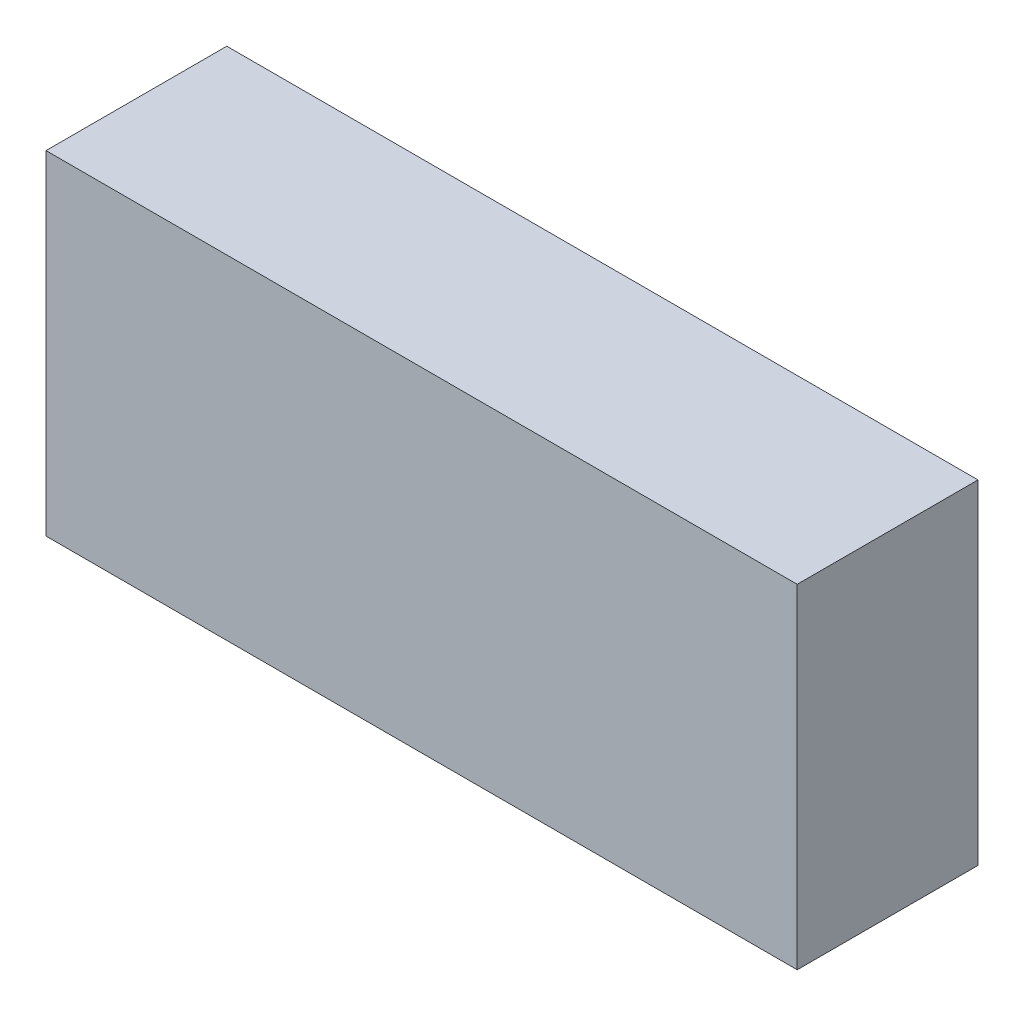
ISO-10303-21;
HEADER;
FILE_DESCRIPTION(('STEP AP214'),'2;1');
FILE_NAME('part.step','',(''),(''),'','','');
FILE_SCHEMA(('AUTOMOTIVE_DESIGN { 1 0 10303 214 1 1 1 1 }'));
ENDSEC;
DATA;
#1=APPLICATION_CONTEXT('core data for automotive mechanical design processes');
#2=APPLICATION_PROTOCOL_DEFINITION('international standard','automotive_design',2000,#1);
#3=PRODUCT_CONTEXT('',#1,'mechanical');
#4=PRODUCT('Part','Part','',(#3));
#5=PRODUCT_RELATED_PRODUCT_CATEGORY('part','',(#4));
#6=PRODUCT_DEFINITION_FORMATION('','',#4);
#7=PRODUCT_DEFINITION_CONTEXT('part definition',#1,'design');
#8=PRODUCT_DEFINITION('design','',#6,#7);
#9=PRODUCT_DEFINITION_SHAPE('','',#8);
#10=(LENGTH_UNIT() NAMED_UNIT(*) SI_UNIT(.MILLI.,.METRE.));
#11=(NAMED_UNIT(*) PLANE_ANGLE_UNIT() SI_UNIT($,.RADIAN.));
#12=(NAMED_UNIT(*) SI_UNIT($,.STERADIAN.) SOLID_ANGLE_UNIT());
#13=UNCERTAINTY_MEASURE_WITH_UNIT(LENGTH_MEASURE(1.E-05),#10,'distance_accuracy_value','');
#14=(GEOMETRIC_REPRESENTATION_CONTEXT(3) GLOBAL_UNCERTAINTY_ASSIGNED_CONTEXT((#13)) GLOBAL_UNIT_ASSIGNED_CONTEXT((#10,
#11,#12)) REPRESENTATION_CONTEXT('',''));
#15=CARTESIAN_POINT('',(0.,0.,0.));
#16=DIRECTION('',(0.,0.,1.));
#17=DIRECTION('',(1.,0.,0.));
#18=AXIS2_PLACEMENT_3D('',#15,#16,#17);
#19=CARTESIAN_POINT('',(-1.661922,-0.738632,0.80000094));
#20=DIRECTION('',(0.,0.,1.));
#21=DIRECTION('',(1.,0.,0.));
#22=AXIS2_PLACEMENT_3D('',#19,#20,#21);
#23=PLANE('',#22);
#24=DIRECTION('',(1.,0.,0.));
#25=VECTOR('',#24,1.);
#26=CARTESIAN_POINT('',(-1.661922,0.738632,0.80000094));
#27=LINE('',#26,#25);
#28=CARTESIAN_POINT('',(-1.661922,0.738632,0.80000094));
#29=VERTEX_POINT('',#28);
#30=CARTESIAN_POINT('',(1.661922,0.738632,0.80000094));
#31=VERTEX_POINT('',#30);
#32=EDGE_CURVE('E53',#29,#31,#27,.T.);
#33=ORIENTED_EDGE('',*,*,#32,.F.);
#34=DIRECTION('',(0.,1.,0.));
#35=VECTOR('',#34,1.);
#36=CARTESIAN_POINT('',(-1.661922,-0.738632,0.80000094));
#37=LINE('',#36,#35);
#38=CARTESIAN_POINT('',(-1.661922,-0.738632,0.80000094));
#39=VERTEX_POINT('',#38);
#40=EDGE_CURVE('E20',#29,#39,#37,.F.);
#41=ORIENTED_EDGE('',*,*,#40,.T.);
#42=DIRECTION('',(1.,0.,0.));
#43=VECTOR('',#42,1.);
#44=CARTESIAN_POINT('',(1.661922,-0.738632,0.80000094));
#45=LINE('',#44,#43);
#46=CARTESIAN_POINT('',(1.661922,-0.738632,0.80000094));
#47=VERTEX_POINT('',#46);
#48=EDGE_CURVE('E67',#47,#39,#45,.F.);
#49=ORIENTED_EDGE('',*,*,#48,.F.);
#50=DIRECTION('',(0.,1.,0.));
#51=VECTOR('',#50,1.);
#52=CARTESIAN_POINT('',(1.661922,0.738632,0.80000094));
#53=LINE('',#52,#51);
#54=EDGE_CURVE('E58',#31,#47,#53,.F.);
#55=ORIENTED_EDGE('',*,*,#54,.F.);
#56=EDGE_LOOP('',(#33,#41,#49,#55));
#57=FACE_BOUND('',#56,.T.);
#58=ADVANCED_FACE('F17',(#57),#23,.T.);
#59=CARTESIAN_POINT('',(1.661922,-0.738632,0.));
#60=DIRECTION('',(0.,-1.,0.));
#61=DIRECTION('',(0.,0.,-1.));
#62=AXIS2_PLACEMENT_3D('',#59,#60,#61);
#63=PLANE('',#62);
#64=DIRECTION('',(0.,0.,1.));
#65=VECTOR('',#64,1.);
#66=CARTESIAN_POINT('',(-1.661922,-0.738632,0.));
#67=LINE('',#66,#65);
#68=CARTESIAN_POINT('',(-1.661922,-0.738632,0.));
#69=VERTEX_POINT('',#68);
#70=EDGE_CURVE('E80',#69,#39,#67,.T.);
#71=ORIENTED_EDGE('',*,*,#70,.F.);
#72=DIRECTION('',(1.,0.,0.));
#73=VECTOR('',#72,1.);
#74=CARTESIAN_POINT('',(-1.661922,-0.738632,0.));
#75=LINE('',#74,#73);
#76=CARTESIAN_POINT('',(1.661922,-0.738632,0.));
#77=VERTEX_POINT('',#76);
#78=EDGE_CURVE('E75',#69,#77,#75,.T.);
#79=ORIENTED_EDGE('',*,*,#78,.T.);
#80=DIRECTION('',(0.,0.,-1.));
#81=VECTOR('',#80,1.);
#82=CARTESIAN_POINT('',(1.661922,-0.738632,0.));
#83=LINE('',#82,#81);
#84=EDGE_CURVE('E63',#47,#77,#83,.T.);
#85=ORIENTED_EDGE('',*,*,#84,.F.);
#86=ORIENTED_EDGE('',*,*,#48,.T.);
#87=EDGE_LOOP('',(#71,#79,#85,#86));
#88=FACE_BOUND('',#87,.T.);
#89=ADVANCED_FACE('F74',(#88),#63,.T.);
#90=CARTESIAN_POINT('',(1.661922,0.738632,0.));
#91=DIRECTION('',(1.,0.,0.));
#92=DIRECTION('',(0.,0.,-1.));
#93=AXIS2_PLACEMENT_3D('',#90,#91,#92);
#94=PLANE('',#93);
#95=ORIENTED_EDGE('',*,*,#84,.T.);
#96=DIRECTION('',(0.,1.,0.));
#97=VECTOR('',#96,1.);
#98=CARTESIAN_POINT('',(1.661922,-0.738632,0.));
#99=LINE('',#98,#97);
#100=CARTESIAN_POINT('',(1.661922,0.738632,0.));
#101=VERTEX_POINT('',#100);
#102=EDGE_CURVE('E84',#77,#101,#99,.T.);
#103=ORIENTED_EDGE('',*,*,#102,.T.);
#104=DIRECTION('',(0.,0.,1.));
#105=VECTOR('',#104,1.);
#106=CARTESIAN_POINT('',(1.661922,0.738632,0.));
#107=LINE('',#106,#105);
#108=EDGE_CURVE('E65',#31,#101,#107,.F.);
#109=ORIENTED_EDGE('',*,*,#108,.F.);
#110=ORIENTED_EDGE('',*,*,#54,.T.);
#111=EDGE_LOOP('',(#95,#103,#109,#110));
#112=FACE_BOUND('',#111,.T.);
#113=ADVANCED_FACE('F60',(#112),#94,.T.);
#114=CARTESIAN_POINT('',(-1.661922,0.738632,0.));
#115=DIRECTION('',(0.,1.,0.));
#116=DIRECTION('',(0.,0.,1.));
#117=AXIS2_PLACEMENT_3D('',#114,#115,#116);
#118=PLANE('',#117);
#119=ORIENTED_EDGE('',*,*,#108,.T.);
#120=DIRECTION('',(1.,0.,0.));
#121=VECTOR('',#120,1.);
#122=CARTESIAN_POINT('',(-1.661922,0.738632,0.));
#123=LINE('',#122,#121);
#124=CARTESIAN_POINT('',(-1.661922,0.738632,0.));
#125=VERTEX_POINT('',#124);
#126=EDGE_CURVE('E26',#101,#125,#123,.F.);
#127=ORIENTED_EDGE('',*,*,#126,.T.);
#128=DIRECTION('',(0.,0.,1.));
#129=VECTOR('',#128,1.);
#130=CARTESIAN_POINT('',(-1.661922,0.738632,0.));
#131=LINE('',#130,#129);
#132=EDGE_CURVE('E34',#29,#125,#131,.F.);
#133=ORIENTED_EDGE('',*,*,#132,.F.);
#134=ORIENTED_EDGE('',*,*,#32,.T.);
#135=EDGE_LOOP('',(#119,#127,#133,#134));
#136=FACE_BOUND('',#135,.T.);
#137=ADVANCED_FACE('F88',(#136),#118,.T.);
#138=CARTESIAN_POINT('',(-1.661922,-0.738632,0.));
#139=DIRECTION('',(-1.,0.,0.));
#140=DIRECTION('',(0.,0.,1.));
#141=AXIS2_PLACEMENT_3D('',#138,#139,#140);
#142=PLANE('',#141);
#143=ORIENTED_EDGE('',*,*,#132,.T.);
#144=DIRECTION('',(0.,1.,0.));
#145=VECTOR('',#144,1.);
#146=CARTESIAN_POINT('',(-1.661922,-0.738632,0.));
#147=LINE('',#146,#145);
#148=EDGE_CURVE('E11',#125,#69,#147,.F.);
#149=ORIENTED_EDGE('',*,*,#148,.T.);
#150=ORIENTED_EDGE('',*,*,#70,.T.);
#151=ORIENTED_EDGE('',*,*,#40,.F.);
#152=EDGE_LOOP('',(#143,#149,#150,#151));
#153=FACE_BOUND('',#152,.T.);
#154=ADVANCED_FACE('F91',(#153),#142,.T.);
#155=CARTESIAN_POINT('',(-1.661922,-0.738632,0.));
#156=DIRECTION('',(0.,0.,1.));
#157=DIRECTION('',(1.,0.,0.));
#158=AXIS2_PLACEMENT_3D('',#155,#156,#157);
#159=PLANE('',#158);
#160=ORIENTED_EDGE('',*,*,#126,.F.);
#161=ORIENTED_EDGE('',*,*,#102,.F.);
#162=ORIENTED_EDGE('',*,*,#78,.F.);
#163=ORIENTED_EDGE('',*,*,#148,.F.);
#164=EDGE_LOOP('',(#160,#161,#162,#163));
#165=FACE_BOUND('',#164,.T.);
#166=ADVANCED_FACE('F90',(#165),#159,.F.);
#167=CLOSED_SHELL('',(#58,#89,#113,#137,#154,#166));
#168=MANIFOLD_SOLID_BREP('B1',#167);
#169=ADVANCED_BREP_SHAPE_REPRESENTATION('',(#18,#168),#14);
#170=SHAPE_DEFINITION_REPRESENTATION(#9,#169);
ENDSEC;
END-ISO-10303-21;
